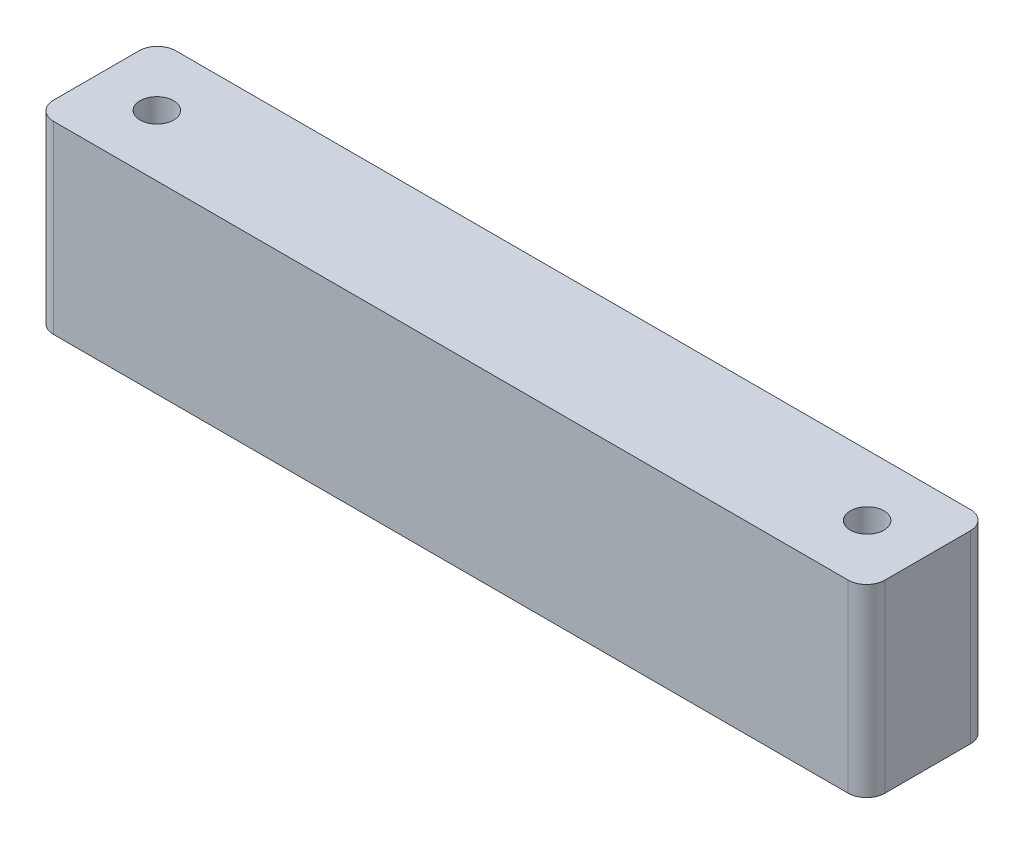
ISO-10303-21;
HEADER;
FILE_DESCRIPTION(('STEP AP214'),'2;1');
FILE_NAME('part.step','',(''),(''),'','','');
FILE_SCHEMA(('AUTOMOTIVE_DESIGN { 1 0 10303 214 1 1 1 1 }'));
ENDSEC;
DATA;
#1=APPLICATION_CONTEXT('core data for automotive mechanical design processes');
#2=APPLICATION_PROTOCOL_DEFINITION('international standard','automotive_design',2000,#1);
#3=PRODUCT_CONTEXT('',#1,'mechanical');
#4=PRODUCT('Part','Part','',(#3));
#5=PRODUCT_RELATED_PRODUCT_CATEGORY('part','',(#4));
#6=PRODUCT_DEFINITION_FORMATION('','',#4);
#7=PRODUCT_DEFINITION_CONTEXT('part definition',#1,'design');
#8=PRODUCT_DEFINITION('design','',#6,#7);
#9=PRODUCT_DEFINITION_SHAPE('','',#8);
#10=(LENGTH_UNIT() NAMED_UNIT(*) SI_UNIT(.MILLI.,.METRE.));
#11=(NAMED_UNIT(*) PLANE_ANGLE_UNIT() SI_UNIT($,.RADIAN.));
#12=(NAMED_UNIT(*) SI_UNIT($,.STERADIAN.) SOLID_ANGLE_UNIT());
#13=UNCERTAINTY_MEASURE_WITH_UNIT(LENGTH_MEASURE(1.E-05),#10,'distance_accuracy_value','');
#14=(GEOMETRIC_REPRESENTATION_CONTEXT(3) GLOBAL_UNCERTAINTY_ASSIGNED_CONTEXT((#13)) GLOBAL_UNIT_ASSIGNED_CONTEXT((#10,
#11,#12)) REPRESENTATION_CONTEXT('',''));
#15=CARTESIAN_POINT('',(0.,0.,0.));
#16=DIRECTION('',(0.,0.,1.));
#17=DIRECTION('',(1.,0.,0.));
#18=AXIS2_PLACEMENT_3D('',#15,#16,#17);
#19=CARTESIAN_POINT('',(65.,30.2,6.99999999999999));
#20=DIRECTION('',(0.,-1.,0.));
#21=DIRECTION('',(0.,0.,-1.));
#22=AXIS2_PLACEMENT_3D('',#19,#20,#21);
#23=CYLINDRICAL_SURFACE('',#22,3.);
#24=CARTESIAN_POINT('',(65.,0.,6.99999999999999));
#25=DIRECTION('',(0.,1.,0.));
#26=DIRECTION('',(0.,0.,1.));
#27=AXIS2_PLACEMENT_3D('',#24,#25,#26);
#28=CIRCLE('',#27,3.);
#29=CARTESIAN_POINT('',(65.,0.,9.99999999999999));
#30=VERTEX_POINT('',#29);
#31=CARTESIAN_POINT('',(68.,0.,6.99999999999999));
#32=VERTEX_POINT('',#31);
#33=EDGE_CURVE('E129',#30,#32,#28,.T.);
#34=ORIENTED_EDGE('',*,*,#33,.T.);
#35=DIRECTION('',(0.,-1.,0.));
#36=VECTOR('',#35,1.);
#37=CARTESIAN_POINT('',(68.,30.2,6.99999999999999));
#38=LINE('',#37,#36);
#39=CARTESIAN_POINT('',(68.,30.2,6.99999999999999));
#40=VERTEX_POINT('',#39);
#41=EDGE_CURVE('E11',#40,#32,#38,.T.);
#42=ORIENTED_EDGE('',*,*,#41,.F.);
#43=CARTESIAN_POINT('',(65.,30.2,6.99999999999999));
#44=DIRECTION('',(0.,1.,0.));
#45=DIRECTION('',(0.,0.,1.));
#46=AXIS2_PLACEMENT_3D('',#43,#44,#45);
#47=CIRCLE('',#46,3.);
#48=CARTESIAN_POINT('',(65.,30.2,9.99999999999999));
#49=VERTEX_POINT('',#48);
#50=EDGE_CURVE('E144',#49,#40,#47,.T.);
#51=ORIENTED_EDGE('',*,*,#50,.F.);
#52=DIRECTION('',(0.,-1.,0.));
#53=VECTOR('',#52,1.);
#54=CARTESIAN_POINT('',(65.,30.2,9.99999999999999));
#55=LINE('',#54,#53);
#56=EDGE_CURVE('E125',#49,#30,#55,.T.);
#57=ORIENTED_EDGE('',*,*,#56,.T.);
#58=EDGE_LOOP('',(#34,#42,#51,#57));
#59=FACE_BOUND('',#58,.T.);
#60=ADVANCED_FACE('F33',(#59),#23,.T.);
#61=CARTESIAN_POINT('',(68.,30.2,6.99999999999999));
#62=DIRECTION('',(-1.,0.,0.));
#63=DIRECTION('',(0.,0.,1.));
#64=AXIS2_PLACEMENT_3D('',#61,#62,#63);
#65=PLANE('',#64);
#66=DIRECTION('',(0.,0.,-1.));
#67=VECTOR('',#66,1.);
#68=CARTESIAN_POINT('',(68.,0.,6.99999999999999));
#69=LINE('',#68,#67);
#70=CARTESIAN_POINT('',(68.,0.,-7.00000000000001));
#71=VERTEX_POINT('',#70);
#72=EDGE_CURVE('E132',#32,#71,#69,.T.);
#73=ORIENTED_EDGE('',*,*,#72,.T.);
#74=DIRECTION('',(0.,-1.,0.));
#75=VECTOR('',#74,1.);
#76=CARTESIAN_POINT('',(68.,30.2,-7.00000000000001));
#77=LINE('',#76,#75);
#78=CARTESIAN_POINT('',(68.,30.2,-7.00000000000001));
#79=VERTEX_POINT('',#78);
#80=EDGE_CURVE('E41',#79,#71,#77,.T.);
#81=ORIENTED_EDGE('',*,*,#80,.F.);
#82=DIRECTION('',(0.,0.,-1.));
#83=VECTOR('',#82,1.);
#84=CARTESIAN_POINT('',(68.,30.2,6.99999999999999));
#85=LINE('',#84,#83);
#86=EDGE_CURVE('E92',#40,#79,#85,.T.);
#87=ORIENTED_EDGE('',*,*,#86,.F.);
#88=ORIENTED_EDGE('',*,*,#41,.T.);
#89=EDGE_LOOP('',(#73,#81,#87,#88));
#90=FACE_BOUND('',#89,.T.);
#91=ADVANCED_FACE('F211',(#90),#65,.F.);
#92=CARTESIAN_POINT('',(65.,30.2,-7.00000000000001));
#93=DIRECTION('',(0.,-1.,0.));
#94=DIRECTION('',(0.,0.,-1.));
#95=AXIS2_PLACEMENT_3D('',#92,#93,#94);
#96=CYLINDRICAL_SURFACE('',#95,3.);
#97=CARTESIAN_POINT('',(65.,0.,-7.00000000000001));
#98=DIRECTION('',(0.,1.,0.));
#99=DIRECTION('',(0.,0.,1.));
#100=AXIS2_PLACEMENT_3D('',#97,#98,#99);
#101=CIRCLE('',#100,3.);
#102=CARTESIAN_POINT('',(65.,0.,-10.));
#103=VERTEX_POINT('',#102);
#104=EDGE_CURVE('E135',#71,#103,#101,.T.);
#105=ORIENTED_EDGE('',*,*,#104,.T.);
#106=DIRECTION('',(0.,-1.,0.));
#107=VECTOR('',#106,1.);
#108=CARTESIAN_POINT('',(65.,30.2,-10.));
#109=LINE('',#108,#107);
#110=CARTESIAN_POINT('',(65.,30.2,-10.));
#111=VERTEX_POINT('',#110);
#112=EDGE_CURVE('E151',#111,#103,#109,.T.);
#113=ORIENTED_EDGE('',*,*,#112,.F.);
#114=CARTESIAN_POINT('',(65.,30.2,-7.00000000000001));
#115=DIRECTION('',(0.,1.,0.));
#116=DIRECTION('',(0.,0.,1.));
#117=AXIS2_PLACEMENT_3D('',#114,#115,#116);
#118=CIRCLE('',#117,3.);
#119=EDGE_CURVE('E159',#79,#111,#118,.T.);
#120=ORIENTED_EDGE('',*,*,#119,.F.);
#121=ORIENTED_EDGE('',*,*,#80,.T.);
#122=EDGE_LOOP('',(#105,#113,#120,#121));
#123=FACE_BOUND('',#122,.T.);
#124=ADVANCED_FACE('F157',(#123),#96,.T.);
#125=CARTESIAN_POINT('',(65.,30.2,-10.));
#126=DIRECTION('',(0.,0.,1.));
#127=DIRECTION('',(1.,0.,0.));
#128=AXIS2_PLACEMENT_3D('',#125,#126,#127);
#129=PLANE('',#128);
#130=DIRECTION('',(-1.,0.,0.));
#131=VECTOR('',#130,1.);
#132=CARTESIAN_POINT('',(65.,0.,-10.));
#133=LINE('',#132,#131);
#134=CARTESIAN_POINT('',(-65.,0.,-9.99999999999999));
#135=VERTEX_POINT('',#134);
#136=EDGE_CURVE('E137',#103,#135,#133,.T.);
#137=ORIENTED_EDGE('',*,*,#136,.T.);
#138=DIRECTION('',(0.,-1.,0.));
#139=VECTOR('',#138,1.);
#140=CARTESIAN_POINT('',(-65.,30.2,-9.99999999999999));
#141=LINE('',#140,#139);
#142=CARTESIAN_POINT('',(-65.,30.2,-9.99999999999999));
#143=VERTEX_POINT('',#142);
#144=EDGE_CURVE('E148',#143,#135,#141,.T.);
#145=ORIENTED_EDGE('',*,*,#144,.F.);
#146=DIRECTION('',(-1.,0.,0.));
#147=VECTOR('',#146,1.);
#148=CARTESIAN_POINT('',(65.,30.2,-10.));
#149=LINE('',#148,#147);
#150=EDGE_CURVE('E171',#111,#143,#149,.T.);
#151=ORIENTED_EDGE('',*,*,#150,.F.);
#152=ORIENTED_EDGE('',*,*,#112,.T.);
#153=EDGE_LOOP('',(#137,#145,#151,#152));
#154=FACE_BOUND('',#153,.T.);
#155=ADVANCED_FACE('F167',(#154),#129,.F.);
#156=CARTESIAN_POINT('',(-65.,30.2,-6.99999999999999));
#157=DIRECTION('',(0.,-1.,0.));
#158=DIRECTION('',(0.,0.,-1.));
#159=AXIS2_PLACEMENT_3D('',#156,#157,#158);
#160=CYLINDRICAL_SURFACE('',#159,3.);
#161=CARTESIAN_POINT('',(-65.,0.,-6.99999999999999));
#162=DIRECTION('',(0.,1.,0.));
#163=DIRECTION('',(0.,0.,1.));
#164=AXIS2_PLACEMENT_3D('',#161,#162,#163);
#165=CIRCLE('',#164,3.);
#166=CARTESIAN_POINT('',(-68.,0.,-6.99999999999999));
#167=VERTEX_POINT('',#166);
#168=EDGE_CURVE('E139',#135,#167,#165,.T.);
#169=ORIENTED_EDGE('',*,*,#168,.T.);
#170=DIRECTION('',(0.,-1.,0.));
#171=VECTOR('',#170,1.);
#172=CARTESIAN_POINT('',(-68.,30.2,-6.99999999999999));
#173=LINE('',#172,#171);
#174=CARTESIAN_POINT('',(-68.,30.2,-6.99999999999999));
#175=VERTEX_POINT('',#174);
#176=EDGE_CURVE('E120',#175,#167,#173,.T.);
#177=ORIENTED_EDGE('',*,*,#176,.F.);
#178=CARTESIAN_POINT('',(-65.,30.2,-6.99999999999999));
#179=DIRECTION('',(0.,1.,0.));
#180=DIRECTION('',(0.,0.,1.));
#181=AXIS2_PLACEMENT_3D('',#178,#179,#180);
#182=CIRCLE('',#181,3.);
#183=EDGE_CURVE('E111',#143,#175,#182,.T.);
#184=ORIENTED_EDGE('',*,*,#183,.F.);
#185=ORIENTED_EDGE('',*,*,#144,.T.);
#186=EDGE_LOOP('',(#169,#177,#184,#185));
#187=FACE_BOUND('',#186,.T.);
#188=ADVANCED_FACE('F170',(#187),#160,.T.);
#189=CARTESIAN_POINT('',(-68.,30.2,7.00000000000001));
#190=DIRECTION('',(1.,0.,0.));
#191=DIRECTION('',(0.,0.,-1.));
#192=AXIS2_PLACEMENT_3D('',#189,#190,#191);
#193=PLANE('',#192);
#194=DIRECTION('',(0.,0.,1.));
#195=VECTOR('',#194,1.);
#196=CARTESIAN_POINT('',(-68.,0.,7.00000000000001));
#197=LINE('',#196,#195);
#198=CARTESIAN_POINT('',(-68.,0.,7.00000000000001));
#199=VERTEX_POINT('',#198);
#200=EDGE_CURVE('E119',#167,#199,#197,.T.);
#201=ORIENTED_EDGE('',*,*,#200,.T.);
#202=DIRECTION('',(0.,-1.,0.));
#203=VECTOR('',#202,1.);
#204=CARTESIAN_POINT('',(-68.,30.2,7.00000000000001));
#205=LINE('',#204,#203);
#206=CARTESIAN_POINT('',(-68.,30.2,7.00000000000001));
#207=VERTEX_POINT('',#206);
#208=EDGE_CURVE('E116',#207,#199,#205,.T.);
#209=ORIENTED_EDGE('',*,*,#208,.F.);
#210=DIRECTION('',(0.,0.,1.));
#211=VECTOR('',#210,1.);
#212=CARTESIAN_POINT('',(-68.,30.2,7.00000000000001));
#213=LINE('',#212,#211);
#214=EDGE_CURVE('E105',#175,#207,#213,.T.);
#215=ORIENTED_EDGE('',*,*,#214,.F.);
#216=ORIENTED_EDGE('',*,*,#176,.T.);
#217=EDGE_LOOP('',(#201,#209,#215,#216));
#218=FACE_BOUND('',#217,.T.);
#219=ADVANCED_FACE('F117',(#218),#193,.F.);
#220=CARTESIAN_POINT('',(-65.,30.2,7.00000000000001));
#221=DIRECTION('',(0.,-1.,0.));
#222=DIRECTION('',(0.,0.,-1.));
#223=AXIS2_PLACEMENT_3D('',#220,#221,#222);
#224=CYLINDRICAL_SURFACE('',#223,3.);
#225=CARTESIAN_POINT('',(-65.,0.,7.00000000000001));
#226=DIRECTION('',(0.,1.,0.));
#227=DIRECTION('',(0.,0.,-1.));
#228=AXIS2_PLACEMENT_3D('',#225,#226,#227);
#229=CIRCLE('',#228,3.);
#230=CARTESIAN_POINT('',(-65.,0.,10.));
#231=VERTEX_POINT('',#230);
#232=EDGE_CURVE('E78',#199,#231,#229,.T.);
#233=ORIENTED_EDGE('',*,*,#232,.T.);
#234=DIRECTION('',(0.,-1.,0.));
#235=VECTOR('',#234,1.);
#236=CARTESIAN_POINT('',(-65.,30.2,10.));
#237=LINE('',#236,#235);
#238=CARTESIAN_POINT('',(-65.,30.2,10.));
#239=VERTEX_POINT('',#238);
#240=EDGE_CURVE('E121',#239,#231,#237,.T.);
#241=ORIENTED_EDGE('',*,*,#240,.F.);
#242=CARTESIAN_POINT('',(-65.,30.2,7.00000000000001));
#243=DIRECTION('',(0.,1.,0.));
#244=DIRECTION('',(0.,0.,-1.));
#245=AXIS2_PLACEMENT_3D('',#242,#243,#244);
#246=CIRCLE('',#245,3.);
#247=EDGE_CURVE('E109',#207,#239,#246,.T.);
#248=ORIENTED_EDGE('',*,*,#247,.F.);
#249=ORIENTED_EDGE('',*,*,#208,.T.);
#250=EDGE_LOOP('',(#233,#241,#248,#249));
#251=FACE_BOUND('',#250,.T.);
#252=ADVANCED_FACE('F123',(#251),#224,.T.);
#253=CARTESIAN_POINT('',(65.,30.2,9.99999999999999));
#254=DIRECTION('',(0.,0.,-1.));
#255=DIRECTION('',(-1.,0.,0.));
#256=AXIS2_PLACEMENT_3D('',#253,#254,#255);
#257=PLANE('',#256);
#258=DIRECTION('',(1.,0.,0.));
#259=VECTOR('',#258,1.);
#260=CARTESIAN_POINT('',(65.,0.,9.99999999999999));
#261=LINE('',#260,#259);
#262=EDGE_CURVE('E84',#231,#30,#261,.T.);
#263=ORIENTED_EDGE('',*,*,#262,.T.);
#264=ORIENTED_EDGE('',*,*,#56,.F.);
#265=DIRECTION('',(1.,0.,0.));
#266=VECTOR('',#265,1.);
#267=CARTESIAN_POINT('',(65.,30.2,9.99999999999999));
#268=LINE('',#267,#266);
#269=EDGE_CURVE('E49',#239,#49,#268,.T.);
#270=ORIENTED_EDGE('',*,*,#269,.F.);
#271=ORIENTED_EDGE('',*,*,#240,.T.);
#272=EDGE_LOOP('',(#263,#264,#270,#271));
#273=FACE_BOUND('',#272,.T.);
#274=ADVANCED_FACE('F193',(#273),#257,.F.);
#275=CARTESIAN_POINT('',(65.,30.2,6.99999999999999));
#276=DIRECTION('',(0.,1.,0.));
#277=DIRECTION('',(0.,0.,1.));
#278=AXIS2_PLACEMENT_3D('',#275,#276,#277);
#279=PLANE('',#278);
#280=CARTESIAN_POINT('',(-58.1,30.2,0.));
#281=DIRECTION('',(0.,1.,0.));
#282=DIRECTION('',(0.,0.,1.));
#283=AXIS2_PLACEMENT_3D('',#280,#281,#282);
#284=CIRCLE('',#283,2.75);
#285=CARTESIAN_POINT('',(-58.1,30.2,2.75));
#286=VERTEX_POINT('',#285);
#287=EDGE_CURVE('E185',#286,#286,#284,.T.);
#288=ORIENTED_EDGE('',*,*,#287,.F.);
#289=EDGE_LOOP('',(#288));
#290=FACE_BOUND('',#289,.T.);
#291=CARTESIAN_POINT('',(58.1,30.2,0.));
#292=DIRECTION('',(0.,1.,0.));
#293=DIRECTION('',(0.,0.,1.));
#294=AXIS2_PLACEMENT_3D('',#291,#292,#293);
#295=CIRCLE('',#294,2.75);
#296=CARTESIAN_POINT('',(58.1,30.2,2.75));
#297=VERTEX_POINT('',#296);
#298=EDGE_CURVE('E179',#297,#297,#295,.T.);
#299=ORIENTED_EDGE('',*,*,#298,.F.);
#300=EDGE_LOOP('',(#299));
#301=FACE_BOUND('',#300,.T.);
#302=ORIENTED_EDGE('',*,*,#50,.T.);
#303=ORIENTED_EDGE('',*,*,#86,.T.);
#304=ORIENTED_EDGE('',*,*,#119,.T.);
#305=ORIENTED_EDGE('',*,*,#150,.T.);
#306=ORIENTED_EDGE('',*,*,#183,.T.);
#307=ORIENTED_EDGE('',*,*,#214,.T.);
#308=ORIENTED_EDGE('',*,*,#247,.T.);
#309=ORIENTED_EDGE('',*,*,#269,.T.);
#310=EDGE_LOOP('',(#302,#303,#304,#305,#306,#307,#308,#309));
#311=FACE_BOUND('',#310,.T.);
#312=ADVANCED_FACE('F107',(#290,#301,#311),#279,.T.);
#313=CARTESIAN_POINT('',(65.,0.,6.99999999999999));
#314=DIRECTION('',(0.,1.,0.));
#315=DIRECTION('',(0.,0.,1.));
#316=AXIS2_PLACEMENT_3D('',#313,#314,#315);
#317=PLANE('',#316);
#318=CARTESIAN_POINT('',(-58.1,0.,0.));
#319=DIRECTION('',(0.,1.,0.));
#320=DIRECTION('',(0.,0.,1.));
#321=AXIS2_PLACEMENT_3D('',#318,#319,#320);
#322=CIRCLE('',#321,2.75);
#323=CARTESIAN_POINT('',(-58.1,0.,2.75));
#324=VERTEX_POINT('',#323);
#325=EDGE_CURVE('E182',#324,#324,#322,.T.);
#326=ORIENTED_EDGE('',*,*,#325,.T.);
#327=EDGE_LOOP('',(#326));
#328=FACE_BOUND('',#327,.T.);
#329=CARTESIAN_POINT('',(58.1,0.,0.));
#330=DIRECTION('',(0.,1.,0.));
#331=DIRECTION('',(0.,0.,1.));
#332=AXIS2_PLACEMENT_3D('',#329,#330,#331);
#333=CIRCLE('',#332,2.75);
#334=CARTESIAN_POINT('',(58.1,0.,2.75));
#335=VERTEX_POINT('',#334);
#336=EDGE_CURVE('E133',#335,#335,#333,.T.);
#337=ORIENTED_EDGE('',*,*,#336,.T.);
#338=EDGE_LOOP('',(#337));
#339=FACE_BOUND('',#338,.T.);
#340=ORIENTED_EDGE('',*,*,#33,.F.);
#341=ORIENTED_EDGE('',*,*,#262,.F.);
#342=ORIENTED_EDGE('',*,*,#232,.F.);
#343=ORIENTED_EDGE('',*,*,#200,.F.);
#344=ORIENTED_EDGE('',*,*,#168,.F.);
#345=ORIENTED_EDGE('',*,*,#136,.F.);
#346=ORIENTED_EDGE('',*,*,#104,.F.);
#347=ORIENTED_EDGE('',*,*,#72,.F.);
#348=EDGE_LOOP('',(#340,#341,#342,#343,#344,#345,#346,#347));
#349=FACE_BOUND('',#348,.T.);
#350=ADVANCED_FACE('F163',(#328,#339,#349),#317,.F.);
#351=CARTESIAN_POINT('',(58.1,30.2,0.));
#352=DIRECTION('',(0.,1.,0.));
#353=DIRECTION('',(0.,0.,1.));
#354=AXIS2_PLACEMENT_3D('',#351,#352,#353);
#355=CYLINDRICAL_SURFACE('',#354,2.75);
#356=ORIENTED_EDGE('',*,*,#336,.F.);
#357=EDGE_LOOP('',(#356));
#358=FACE_BOUND('',#357,.T.);
#359=ORIENTED_EDGE('',*,*,#298,.T.);
#360=EDGE_LOOP('',(#359));
#361=FACE_BOUND('',#360,.T.);
#362=ADVANCED_FACE('F197',(#358,#361),#355,.F.);
#363=CARTESIAN_POINT('',(-58.1,30.2,0.));
#364=DIRECTION('',(0.,1.,0.));
#365=DIRECTION('',(0.,0.,1.));
#366=AXIS2_PLACEMENT_3D('',#363,#364,#365);
#367=CYLINDRICAL_SURFACE('',#366,2.75);
#368=ORIENTED_EDGE('',*,*,#325,.F.);
#369=EDGE_LOOP('',(#368));
#370=FACE_BOUND('',#369,.T.);
#371=ORIENTED_EDGE('',*,*,#287,.T.);
#372=EDGE_LOOP('',(#371));
#373=FACE_BOUND('',#372,.T.);
#374=ADVANCED_FACE('F189',(#370,#373),#367,.F.);
#375=CLOSED_SHELL('',(#60,#91,#124,#155,#188,#219,#252,#274,#312,#350,#362,#374));
#376=MANIFOLD_SOLID_BREP('B2',#375);
#377=ADVANCED_BREP_SHAPE_REPRESENTATION('',(#18,#376),#14);
#378=SHAPE_DEFINITION_REPRESENTATION(#9,#377);
ENDSEC;
END-ISO-10303-21;
